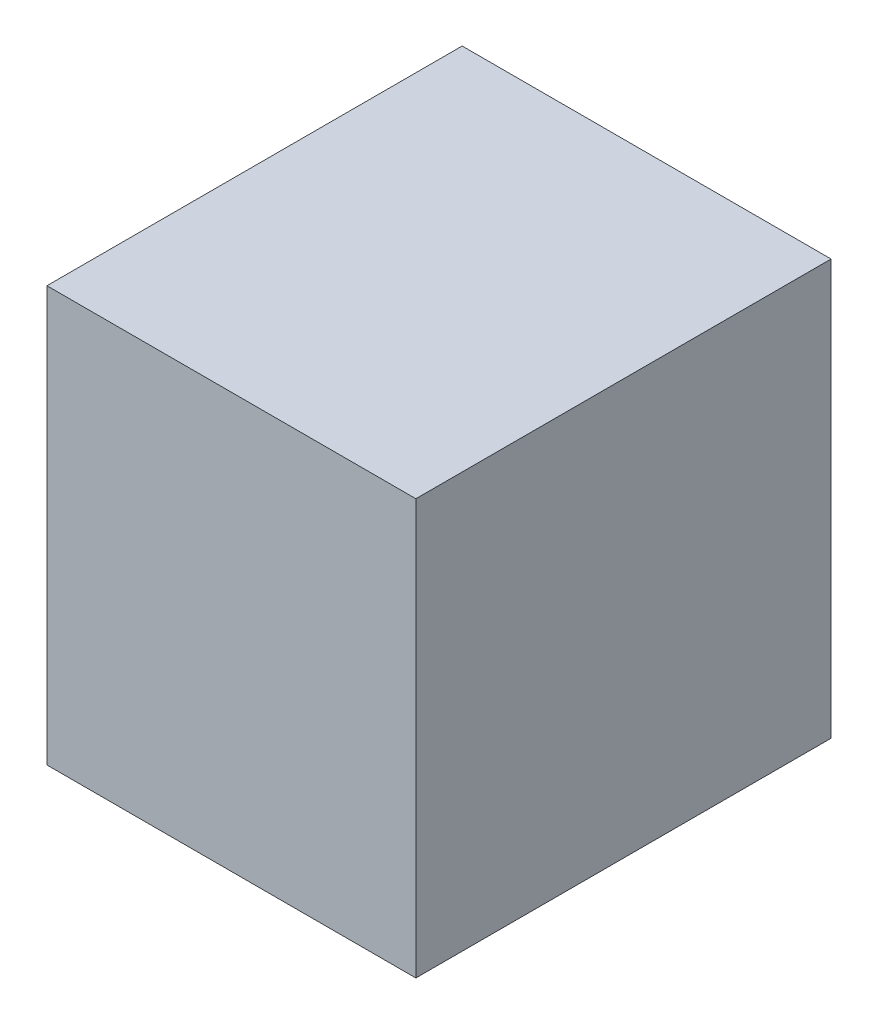
ISO-10303-21;
HEADER;
FILE_DESCRIPTION(('STEP AP214'),'2;1');
FILE_NAME('part.step','',(''),(''),'','','');
FILE_SCHEMA(('AUTOMOTIVE_DESIGN { 1 0 10303 214 1 1 1 1 }'));
ENDSEC;
DATA;
#1=APPLICATION_CONTEXT('core data for automotive mechanical design processes');
#2=APPLICATION_PROTOCOL_DEFINITION('international standard','automotive_design',2000,#1);
#3=PRODUCT_CONTEXT('',#1,'mechanical');
#4=PRODUCT('Part','Part','',(#3));
#5=PRODUCT_RELATED_PRODUCT_CATEGORY('part','',(#4));
#6=PRODUCT_DEFINITION_FORMATION('','',#4);
#7=PRODUCT_DEFINITION_CONTEXT('part definition',#1,'design');
#8=PRODUCT_DEFINITION('design','',#6,#7);
#9=PRODUCT_DEFINITION_SHAPE('','',#8);
#10=(LENGTH_UNIT() NAMED_UNIT(*) SI_UNIT(.MILLI.,.METRE.));
#11=(NAMED_UNIT(*) PLANE_ANGLE_UNIT() SI_UNIT($,.RADIAN.));
#12=(NAMED_UNIT(*) SI_UNIT($,.STERADIAN.) SOLID_ANGLE_UNIT());
#13=UNCERTAINTY_MEASURE_WITH_UNIT(LENGTH_MEASURE(1.E-05),#10,'distance_accuracy_value','');
#14=(GEOMETRIC_REPRESENTATION_CONTEXT(3) GLOBAL_UNCERTAINTY_ASSIGNED_CONTEXT((#13)) GLOBAL_UNIT_ASSIGNED_CONTEXT((#10,
#11,#12)) REPRESENTATION_CONTEXT('',''));
#15=CARTESIAN_POINT('',(0.,0.,0.));
#16=DIRECTION('',(0.,0.,1.));
#17=DIRECTION('',(1.,0.,0.));
#18=AXIS2_PLACEMENT_3D('',#15,#16,#17);
#19=CARTESIAN_POINT('',(1.19949468,1.34949184,0.));
#20=DIRECTION('',(1.,0.,0.));
#21=DIRECTION('',(0.,0.,-1.));
#22=AXIS2_PLACEMENT_3D('',#19,#20,#21);
#23=PLANE('',#22);
#24=DIRECTION('',(0.,0.,-1.));
#25=VECTOR('',#24,1.);
#26=CARTESIAN_POINT('',(1.19949468,-1.34949184,0.));
#27=LINE('',#26,#25);
#28=CARTESIAN_POINT('',(1.19949468,-1.34949184,0.));
#29=VERTEX_POINT('',#28);
#30=CARTESIAN_POINT('',(1.19949468,-1.34949184,2.69999968));
#31=VERTEX_POINT('',#30);
#32=EDGE_CURVE('E20',#29,#31,#27,.F.);
#33=ORIENTED_EDGE('',*,*,#32,.F.);
#34=DIRECTION('',(0.,1.,0.));
#35=VECTOR('',#34,1.);
#36=CARTESIAN_POINT('',(1.19949468,0.,0.));
#37=LINE('',#36,#35);
#38=CARTESIAN_POINT('',(1.19949468,1.34949184,0.));
#39=VERTEX_POINT('',#38);
#40=EDGE_CURVE('E80',#39,#29,#37,.F.);
#41=ORIENTED_EDGE('',*,*,#40,.F.);
#42=DIRECTION('',(0.,0.,1.));
#43=VECTOR('',#42,1.);
#44=CARTESIAN_POINT('',(1.19949468,1.34949184,0.));
#45=LINE('',#44,#43);
#46=CARTESIAN_POINT('',(1.19949468,1.34949184,2.69999968));
#47=VERTEX_POINT('',#46);
#48=EDGE_CURVE('E61',#47,#39,#45,.F.);
#49=ORIENTED_EDGE('',*,*,#48,.F.);
#50=DIRECTION('',(0.,1.,0.));
#51=VECTOR('',#50,1.);
#52=CARTESIAN_POINT('',(1.19949468,0.,2.69999968));
#53=LINE('',#52,#51);
#54=EDGE_CURVE('E55',#47,#31,#53,.F.);
#55=ORIENTED_EDGE('',*,*,#54,.T.);
#56=EDGE_LOOP('',(#33,#41,#49,#55));
#57=FACE_BOUND('',#56,.T.);
#58=ADVANCED_FACE('F17',(#57),#23,.T.);
#59=CARTESIAN_POINT('',(1.19949468,-1.34949184,0.));
#60=DIRECTION('',(0.,-1.,0.));
#61=DIRECTION('',(0.,0.,-1.));
#62=AXIS2_PLACEMENT_3D('',#59,#60,#61);
#63=PLANE('',#62);
#64=DIRECTION('',(0.,0.,1.));
#65=VECTOR('',#64,1.);
#66=CARTESIAN_POINT('',(-1.19949468,-1.34949184,0.));
#67=LINE('',#66,#65);
#68=CARTESIAN_POINT('',(-1.19949468,-1.34949184,0.));
#69=VERTEX_POINT('',#68);
#70=CARTESIAN_POINT('',(-1.19949468,-1.34949184,2.69999968));
#71=VERTEX_POINT('',#70);
#72=EDGE_CURVE('E83',#69,#71,#67,.T.);
#73=ORIENTED_EDGE('',*,*,#72,.F.);
#74=DIRECTION('',(-1.,0.,0.));
#75=VECTOR('',#74,1.);
#76=CARTESIAN_POINT('',(0.,-1.34949184,0.));
#77=LINE('',#76,#75);
#78=EDGE_CURVE('E68',#29,#69,#77,.T.);
#79=ORIENTED_EDGE('',*,*,#78,.F.);
#80=ORIENTED_EDGE('',*,*,#32,.T.);
#81=DIRECTION('',(-1.,0.,0.));
#82=VECTOR('',#81,1.);
#83=CARTESIAN_POINT('',(0.,-1.34949184,2.69999968));
#84=LINE('',#83,#82);
#85=EDGE_CURVE('E63',#31,#71,#84,.T.);
#86=ORIENTED_EDGE('',*,*,#85,.T.);
#87=EDGE_LOOP('',(#73,#79,#80,#86));
#88=FACE_BOUND('',#87,.T.);
#89=ADVANCED_FACE('F65',(#88),#63,.T.);
#90=CARTESIAN_POINT('',(0.,0.,2.69999968));
#91=DIRECTION('',(0.,0.,-1.));
#92=DIRECTION('',(-1.,0.,0.));
#93=AXIS2_PLACEMENT_3D('',#90,#91,#92);
#94=PLANE('',#93);
#95=ORIENTED_EDGE('',*,*,#54,.F.);
#96=DIRECTION('',(1.,0.,0.));
#97=VECTOR('',#96,1.);
#98=CARTESIAN_POINT('',(-1.19949468,1.34949184,2.69999968));
#99=LINE('',#98,#97);
#100=CARTESIAN_POINT('',(-1.19949468,1.34949184,2.69999968));
#101=VERTEX_POINT('',#100);
#102=EDGE_CURVE('E74',#101,#47,#99,.T.);
#103=ORIENTED_EDGE('',*,*,#102,.F.);
#104=DIRECTION('',(0.,1.,0.));
#105=VECTOR('',#104,1.);
#106=CARTESIAN_POINT('',(-1.19949468,-1.34949184,2.69999968));
#107=LINE('',#106,#105);
#108=EDGE_CURVE('E72',#71,#101,#107,.T.);
#109=ORIENTED_EDGE('',*,*,#108,.F.);
#110=ORIENTED_EDGE('',*,*,#85,.F.);
#111=EDGE_LOOP('',(#95,#103,#109,#110));
#112=FACE_BOUND('',#111,.T.);
#113=ADVANCED_FACE('F70',(#112),#94,.F.);
#114=CARTESIAN_POINT('',(-1.19949468,1.34949184,0.));
#115=DIRECTION('',(0.,1.,0.));
#116=DIRECTION('',(0.,0.,1.));
#117=AXIS2_PLACEMENT_3D('',#114,#115,#116);
#118=PLANE('',#117);
#119=ORIENTED_EDGE('',*,*,#48,.T.);
#120=DIRECTION('',(-1.,0.,0.));
#121=VECTOR('',#120,1.);
#122=CARTESIAN_POINT('',(0.,1.34949184,0.));
#123=LINE('',#122,#121);
#124=CARTESIAN_POINT('',(-1.19949468,1.34949184,0.));
#125=VERTEX_POINT('',#124);
#126=EDGE_CURVE('E35',#125,#39,#123,.F.);
#127=ORIENTED_EDGE('',*,*,#126,.F.);
#128=DIRECTION('',(0.,0.,1.));
#129=VECTOR('',#128,1.);
#130=CARTESIAN_POINT('',(-1.19949468,1.34949184,0.));
#131=LINE('',#130,#129);
#132=EDGE_CURVE('E26',#101,#125,#131,.F.);
#133=ORIENTED_EDGE('',*,*,#132,.F.);
#134=ORIENTED_EDGE('',*,*,#102,.T.);
#135=EDGE_LOOP('',(#119,#127,#133,#134));
#136=FACE_BOUND('',#135,.T.);
#137=ADVANCED_FACE('F89',(#136),#118,.T.);
#138=CARTESIAN_POINT('',(0.,0.,0.));
#139=DIRECTION('',(0.,0.,-1.));
#140=DIRECTION('',(-1.,0.,0.));
#141=AXIS2_PLACEMENT_3D('',#138,#139,#140);
#142=PLANE('',#141);
#143=ORIENTED_EDGE('',*,*,#40,.T.);
#144=ORIENTED_EDGE('',*,*,#78,.T.);
#145=DIRECTION('',(0.,1.,0.));
#146=VECTOR('',#145,1.);
#147=CARTESIAN_POINT('',(-1.19949468,-1.34949184,0.));
#148=LINE('',#147,#146);
#149=EDGE_CURVE('E11',#125,#69,#148,.F.);
#150=ORIENTED_EDGE('',*,*,#149,.F.);
#151=ORIENTED_EDGE('',*,*,#126,.T.);
#152=EDGE_LOOP('',(#143,#144,#150,#151));
#153=FACE_BOUND('',#152,.T.);
#154=ADVANCED_FACE('F91',(#153),#142,.T.);
#155=CARTESIAN_POINT('',(-1.19949468,-1.34949184,0.));
#156=DIRECTION('',(-1.,0.,0.));
#157=DIRECTION('',(0.,0.,1.));
#158=AXIS2_PLACEMENT_3D('',#155,#156,#157);
#159=PLANE('',#158);
#160=ORIENTED_EDGE('',*,*,#132,.T.);
#161=ORIENTED_EDGE('',*,*,#149,.T.);
#162=ORIENTED_EDGE('',*,*,#72,.T.);
#163=ORIENTED_EDGE('',*,*,#108,.T.);
#164=EDGE_LOOP('',(#160,#161,#162,#163));
#165=FACE_BOUND('',#164,.T.);
#166=ADVANCED_FACE('F88',(#165),#159,.T.);
#167=CLOSED_SHELL('',(#58,#89,#113,#137,#154,#166));
#168=MANIFOLD_SOLID_BREP('B1',#167);
#169=ADVANCED_BREP_SHAPE_REPRESENTATION('',(#18,#168),#14);
#170=SHAPE_DEFINITION_REPRESENTATION(#9,#169);
ENDSEC;
END-ISO-10303-21;
